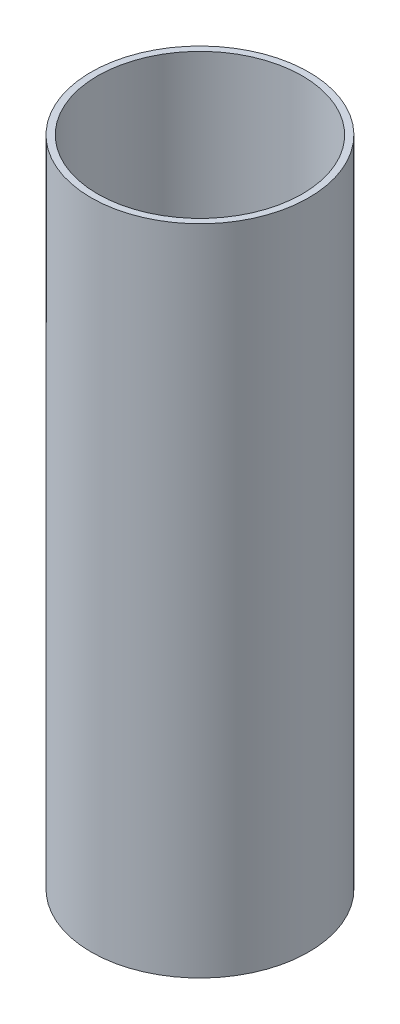
ISO-10303-21;
HEADER;
FILE_DESCRIPTION(('STEP AP214'),'2;1');
FILE_NAME('part.step','',(''),(''),'','','');
FILE_SCHEMA(('AUTOMOTIVE_DESIGN { 1 0 10303 214 1 1 1 1 }'));
ENDSEC;
DATA;
#1=APPLICATION_CONTEXT('core data for automotive mechanical design processes');
#2=APPLICATION_PROTOCOL_DEFINITION('international standard','automotive_design',2000,#1);
#3=PRODUCT_CONTEXT('',#1,'mechanical');
#4=PRODUCT('Part','Part','',(#3));
#5=PRODUCT_RELATED_PRODUCT_CATEGORY('part','',(#4));
#6=PRODUCT_DEFINITION_FORMATION('','',#4);
#7=PRODUCT_DEFINITION_CONTEXT('part definition',#1,'design');
#8=PRODUCT_DEFINITION('design','',#6,#7);
#9=PRODUCT_DEFINITION_SHAPE('','',#8);
#10=(LENGTH_UNIT() NAMED_UNIT(*) SI_UNIT(.MILLI.,.METRE.));
#11=(NAMED_UNIT(*) PLANE_ANGLE_UNIT() SI_UNIT($,.RADIAN.));
#12=(NAMED_UNIT(*) SI_UNIT($,.STERADIAN.) SOLID_ANGLE_UNIT());
#13=UNCERTAINTY_MEASURE_WITH_UNIT(LENGTH_MEASURE(1.E-05),#10,'distance_accuracy_value','');
#14=(GEOMETRIC_REPRESENTATION_CONTEXT(3) GLOBAL_UNCERTAINTY_ASSIGNED_CONTEXT((#13)) GLOBAL_UNIT_ASSIGNED_CONTEXT((#10,
#11,#12)) REPRESENTATION_CONTEXT('',''));
#15=CARTESIAN_POINT('',(0.,0.,0.));
#16=DIRECTION('',(0.,0.,1.));
#17=DIRECTION('',(1.,0.,0.));
#18=AXIS2_PLACEMENT_3D('',#15,#16,#17);
#19=CARTESIAN_POINT('',(0.,0.,0.));
#20=DIRECTION('',(0.,1.,0.));
#21=DIRECTION('',(0.,0.,1.));
#22=AXIS2_PLACEMENT_3D('',#19,#20,#21);
#23=CYLINDRICAL_SURFACE('',#22,6.35);
#24=CARTESIAN_POINT('',(0.,38.1,0.));
#25=DIRECTION('',(0.,1.,0.));
#26=DIRECTION('',(0.,0.,1.));
#27=AXIS2_PLACEMENT_3D('',#24,#25,#26);
#28=CIRCLE('',#27,6.35);
#29=CARTESIAN_POINT('',(0.,38.1,6.35));
#30=VERTEX_POINT('',#29);
#31=EDGE_CURVE('E44',#30,#30,#28,.T.);
#32=ORIENTED_EDGE('',*,*,#31,.F.);
#33=EDGE_LOOP('',(#32));
#34=FACE_BOUND('',#33,.T.);
#35=CARTESIAN_POINT('',(0.,0.,0.));
#36=DIRECTION('',(0.,1.,0.));
#37=DIRECTION('',(0.,0.,1.));
#38=AXIS2_PLACEMENT_3D('',#35,#36,#37);
#39=CIRCLE('',#38,6.35);
#40=CARTESIAN_POINT('',(0.,0.,6.35));
#41=VERTEX_POINT('',#40);
#42=EDGE_CURVE('E35',#41,#41,#39,.T.);
#43=ORIENTED_EDGE('',*,*,#42,.T.);
#44=EDGE_LOOP('',(#43));
#45=FACE_BOUND('',#44,.T.);
#46=ADVANCED_FACE('F32',(#34,#45),#23,.T.);
#47=CARTESIAN_POINT('',(0.,0.,0.));
#48=DIRECTION('',(0.,1.,0.));
#49=DIRECTION('',(0.,0.,1.));
#50=AXIS2_PLACEMENT_3D('',#47,#48,#49);
#51=PLANE('',#50);
#52=CARTESIAN_POINT('',(0.,0.,0.));
#53=DIRECTION('',(0.,1.,0.));
#54=DIRECTION('',(0.,0.,1.));
#55=AXIS2_PLACEMENT_3D('',#52,#53,#54);
#56=CIRCLE('',#55,5.969);
#57=CARTESIAN_POINT('',(0.,0.,5.969));
#58=VERTEX_POINT('',#57);
#59=EDGE_CURVE('E39',#58,#58,#56,.F.);
#60=ORIENTED_EDGE('',*,*,#59,.F.);
#61=EDGE_LOOP('',(#60));
#62=FACE_BOUND('',#61,.T.);
#63=ORIENTED_EDGE('',*,*,#42,.F.);
#64=EDGE_LOOP('',(#63));
#65=FACE_BOUND('',#64,.T.);
#66=ADVANCED_FACE('F53',(#62,#65),#51,.F.);
#67=CARTESIAN_POINT('',(0.,38.1,0.));
#68=DIRECTION('',(0.,1.,0.));
#69=DIRECTION('',(0.,0.,1.));
#70=AXIS2_PLACEMENT_3D('',#67,#68,#69);
#71=PLANE('',#70);
#72=CARTESIAN_POINT('',(0.,38.1,0.));
#73=DIRECTION('',(0.,1.,0.));
#74=DIRECTION('',(0.,0.,1.));
#75=AXIS2_PLACEMENT_3D('',#72,#73,#74);
#76=CIRCLE('',#75,5.969);
#77=CARTESIAN_POINT('',(0.,38.1,5.969));
#78=VERTEX_POINT('',#77);
#79=EDGE_CURVE('E10',#78,#78,#76,.F.);
#80=ORIENTED_EDGE('',*,*,#79,.T.);
#81=EDGE_LOOP('',(#80));
#82=FACE_BOUND('',#81,.T.);
#83=ORIENTED_EDGE('',*,*,#31,.T.);
#84=EDGE_LOOP('',(#83));
#85=FACE_BOUND('',#84,.T.);
#86=ADVANCED_FACE('F55',(#82,#85),#71,.T.);
#87=CARTESIAN_POINT('',(0.,0.,0.));
#88=DIRECTION('',(0.,1.,0.));
#89=DIRECTION('',(0.,0.,1.));
#90=AXIS2_PLACEMENT_3D('',#87,#88,#89);
#91=CYLINDRICAL_SURFACE('',#90,5.969);
#92=ORIENTED_EDGE('',*,*,#79,.F.);
#93=EDGE_LOOP('',(#92));
#94=FACE_BOUND('',#93,.T.);
#95=ORIENTED_EDGE('',*,*,#59,.T.);
#96=EDGE_LOOP('',(#95));
#97=FACE_BOUND('',#96,.T.);
#98=ADVANCED_FACE('F61',(#94,#97),#91,.F.);
#99=CLOSED_SHELL('',(#46,#66,#86,#98));
#100=MANIFOLD_SOLID_BREP('B2',#99);
#101=ADVANCED_BREP_SHAPE_REPRESENTATION('',(#18,#100),#14);
#102=SHAPE_DEFINITION_REPRESENTATION(#9,#101);
ENDSEC;
END-ISO-10303-21;
